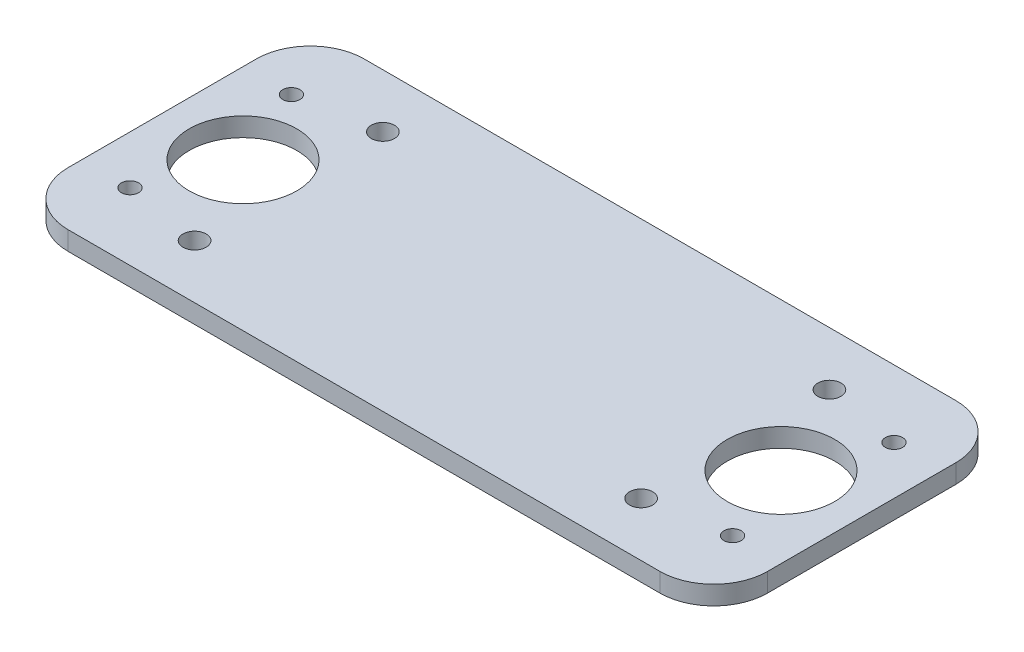
ISO-10303-21;
HEADER;
FILE_DESCRIPTION(('STEP AP214'),'2;1');
FILE_NAME('part.step','',(''),(''),'','','');
FILE_SCHEMA(('AUTOMOTIVE_DESIGN { 1 0 10303 214 1 1 1 1 }'));
ENDSEC;
DATA;
#1=APPLICATION_CONTEXT('core data for automotive mechanical design processes');
#2=APPLICATION_PROTOCOL_DEFINITION('international standard','automotive_design',2000,#1);
#3=PRODUCT_CONTEXT('',#1,'mechanical');
#4=PRODUCT('Part','Part','',(#3));
#5=PRODUCT_RELATED_PRODUCT_CATEGORY('part','',(#4));
#6=PRODUCT_DEFINITION_FORMATION('','',#4);
#7=PRODUCT_DEFINITION_CONTEXT('part definition',#1,'design');
#8=PRODUCT_DEFINITION('design','',#6,#7);
#9=PRODUCT_DEFINITION_SHAPE('','',#8);
#10=(LENGTH_UNIT() NAMED_UNIT(*) SI_UNIT(.MILLI.,.METRE.));
#11=(NAMED_UNIT(*) PLANE_ANGLE_UNIT() SI_UNIT($,.RADIAN.));
#12=(NAMED_UNIT(*) SI_UNIT($,.STERADIAN.) SOLID_ANGLE_UNIT());
#13=UNCERTAINTY_MEASURE_WITH_UNIT(LENGTH_MEASURE(1.E-05),#10,'distance_accuracy_value','');
#14=(GEOMETRIC_REPRESENTATION_CONTEXT(3) GLOBAL_UNCERTAINTY_ASSIGNED_CONTEXT((#13)) GLOBAL_UNIT_ASSIGNED_CONTEXT((#10,
#11,#12)) REPRESENTATION_CONTEXT('',''));
#15=CARTESIAN_POINT('',(0.,0.,0.));
#16=DIRECTION('',(0.,0.,1.));
#17=DIRECTION('',(1.,0.,0.));
#18=AXIS2_PLACEMENT_3D('',#15,#16,#17);
#19=CARTESIAN_POINT('',(0.,3.5,0.));
#20=DIRECTION('',(0.,1.,0.));
#21=DIRECTION('',(0.,0.,1.));
#22=AXIS2_PLACEMENT_3D('',#19,#20,#21);
#23=PLANE('',#22);
#24=CARTESIAN_POINT('',(15.,3.5,27.5));
#25=DIRECTION('',(0.,1.,0.));
#26=DIRECTION('',(0.,0.,1.));
#27=AXIS2_PLACEMENT_3D('',#24,#25,#26);
#28=CIRCLE('',#27,10.);
#29=CARTESIAN_POINT('',(15.,3.5,37.5));
#30=VERTEX_POINT('',#29);
#31=EDGE_CURVE('E255',#30,#30,#28,.T.);
#32=ORIENTED_EDGE('',*,*,#31,.F.);
#33=EDGE_LOOP('',(#32));
#34=FACE_BOUND('',#33,.T.);
#35=CARTESIAN_POINT('',(23.5,3.5,10.));
#36=DIRECTION('',(0.,1.,0.));
#37=DIRECTION('',(0.,0.,-1.));
#38=AXIS2_PLACEMENT_3D('',#35,#36,#37);
#39=CIRCLE('',#38,2.15);
#40=CARTESIAN_POINT('',(23.5,3.5,7.85));
#41=VERTEX_POINT('',#40);
#42=EDGE_CURVE('E239',#41,#41,#39,.T.);
#43=ORIENTED_EDGE('',*,*,#42,.F.);
#44=EDGE_LOOP('',(#43));
#45=FACE_BOUND('',#44,.T.);
#46=CARTESIAN_POINT('',(121.,3.5,42.5));
#47=DIRECTION('',(0.,1.,0.));
#48=DIRECTION('',(0.,0.,-1.));
#49=AXIS2_PLACEMENT_3D('',#46,#47,#48);
#50=CIRCLE('',#49,1.59999999999999);
#51=CARTESIAN_POINT('',(121.,3.5,40.9));
#52=VERTEX_POINT('',#51);
#53=EDGE_CURVE('E223',#52,#52,#50,.T.);
#54=ORIENTED_EDGE('',*,*,#53,.F.);
#55=EDGE_LOOP('',(#54));
#56=FACE_BOUND('',#55,.T.);
#57=CARTESIAN_POINT('',(106.5,3.5,10.));
#58=DIRECTION('',(0.,1.,0.));
#59=DIRECTION('',(0.,0.,1.));
#60=AXIS2_PLACEMENT_3D('',#57,#58,#59);
#61=CIRCLE('',#60,2.15);
#62=CARTESIAN_POINT('',(106.5,3.5,12.15));
#63=VERTEX_POINT('',#62);
#64=EDGE_CURVE('E207',#63,#63,#61,.T.);
#65=ORIENTED_EDGE('',*,*,#64,.F.);
#66=EDGE_LOOP('',(#65));
#67=FACE_BOUND('',#66,.T.);
#68=CARTESIAN_POINT('',(9.,3.5,12.5));
#69=DIRECTION('',(0.,1.,0.));
#70=DIRECTION('',(0.,0.,1.));
#71=AXIS2_PLACEMENT_3D('',#68,#69,#70);
#72=CIRCLE('',#71,1.6);
#73=CARTESIAN_POINT('',(9.,3.5,14.1));
#74=VERTEX_POINT('',#73);
#75=EDGE_CURVE('E137',#74,#74,#72,.T.);
#76=ORIENTED_EDGE('',*,*,#75,.F.);
#77=EDGE_LOOP('',(#76));
#78=FACE_BOUND('',#77,.T.);
#79=DIRECTION('',(-1.,0.,0.));
#80=VECTOR('',#79,1.);
#81=CARTESIAN_POINT('',(0.,3.5,0.));
#82=LINE('',#81,#80);
#83=CARTESIAN_POINT('',(120.,3.5,0.));
#84=VERTEX_POINT('',#83);
#85=CARTESIAN_POINT('',(10.,3.5,0.));
#86=VERTEX_POINT('',#85);
#87=EDGE_CURVE('E148',#84,#86,#82,.T.);
#88=ORIENTED_EDGE('',*,*,#87,.T.);
#89=CARTESIAN_POINT('',(10.,3.5,10.));
#90=DIRECTION('',(0.,1.,0.));
#91=DIRECTION('',(0.,0.,1.));
#92=AXIS2_PLACEMENT_3D('',#89,#90,#91);
#93=CIRCLE('',#92,10.);
#94=CARTESIAN_POINT('',(0.,3.5,10.));
#95=VERTEX_POINT('',#94);
#96=EDGE_CURVE('E178',#86,#95,#93,.T.);
#97=ORIENTED_EDGE('',*,*,#96,.T.);
#98=DIRECTION('',(0.,0.,1.));
#99=VECTOR('',#98,1.);
#100=CARTESIAN_POINT('',(0.,3.5,0.));
#101=LINE('',#100,#99);
#102=CARTESIAN_POINT('',(0.,3.5,45.));
#103=VERTEX_POINT('',#102);
#104=EDGE_CURVE('E127',#95,#103,#101,.T.);
#105=ORIENTED_EDGE('',*,*,#104,.T.);
#106=CARTESIAN_POINT('',(10.,3.5,45.));
#107=DIRECTION('',(0.,1.,0.));
#108=DIRECTION('',(0.,0.,1.));
#109=AXIS2_PLACEMENT_3D('',#106,#107,#108);
#110=CIRCLE('',#109,10.);
#111=CARTESIAN_POINT('',(10.,3.5,55.));
#112=VERTEX_POINT('',#111);
#113=EDGE_CURVE('E175',#103,#112,#110,.T.);
#114=ORIENTED_EDGE('',*,*,#113,.T.);
#115=DIRECTION('',(1.,0.,0.));
#116=VECTOR('',#115,1.);
#117=CARTESIAN_POINT('',(0.,3.5,55.));
#118=LINE('',#117,#116);
#119=CARTESIAN_POINT('',(120.,3.5,55.));
#120=VERTEX_POINT('',#119);
#121=EDGE_CURVE('E193',#112,#120,#118,.T.);
#122=ORIENTED_EDGE('',*,*,#121,.T.);
#123=CARTESIAN_POINT('',(120.,3.5,45.));
#124=DIRECTION('',(0.,1.,0.));
#125=DIRECTION('',(0.,0.,1.));
#126=AXIS2_PLACEMENT_3D('',#123,#124,#125);
#127=CIRCLE('',#126,10.);
#128=CARTESIAN_POINT('',(130.,3.5,45.));
#129=VERTEX_POINT('',#128);
#130=EDGE_CURVE('E61',#120,#129,#127,.T.);
#131=ORIENTED_EDGE('',*,*,#130,.T.);
#132=DIRECTION('',(0.,0.,-1.));
#133=VECTOR('',#132,1.);
#134=CARTESIAN_POINT('',(130.,3.5,0.));
#135=LINE('',#134,#133);
#136=CARTESIAN_POINT('',(130.,3.5,10.));
#137=VERTEX_POINT('',#136);
#138=EDGE_CURVE('E191',#129,#137,#135,.T.);
#139=ORIENTED_EDGE('',*,*,#138,.T.);
#140=CARTESIAN_POINT('',(120.,3.5,10.));
#141=DIRECTION('',(0.,1.,0.));
#142=DIRECTION('',(0.,0.,1.));
#143=AXIS2_PLACEMENT_3D('',#140,#141,#142);
#144=CIRCLE('',#143,10.);
#145=EDGE_CURVE('E170',#137,#84,#144,.T.);
#146=ORIENTED_EDGE('',*,*,#145,.T.);
#147=EDGE_LOOP('',(#88,#97,#105,#114,#122,#131,#139,#146));
#148=FACE_BOUND('',#147,.T.);
#149=CARTESIAN_POINT('',(9.00000000000007,3.5,42.5));
#150=DIRECTION('',(0.,1.,0.));
#151=DIRECTION('',(0.,0.,1.));
#152=AXIS2_PLACEMENT_3D('',#149,#150,#151);
#153=CIRCLE('',#152,1.59999999999993);
#154=CARTESIAN_POINT('',(9.00000000000007,3.5,44.0999999999999));
#155=VERTEX_POINT('',#154);
#156=EDGE_CURVE('E201',#155,#155,#153,.T.);
#157=ORIENTED_EDGE('',*,*,#156,.F.);
#158=EDGE_LOOP('',(#157));
#159=FACE_BOUND('',#158,.T.);
#160=CARTESIAN_POINT('',(106.5,3.5,45.));
#161=DIRECTION('',(0.,1.,0.));
#162=DIRECTION('',(0.,0.,1.));
#163=AXIS2_PLACEMENT_3D('',#160,#161,#162);
#164=CIRCLE('',#163,2.15);
#165=CARTESIAN_POINT('',(106.5,3.5,47.15));
#166=VERTEX_POINT('',#165);
#167=EDGE_CURVE('E215',#166,#166,#164,.T.);
#168=ORIENTED_EDGE('',*,*,#167,.F.);
#169=EDGE_LOOP('',(#168));
#170=FACE_BOUND('',#169,.T.);
#171=CARTESIAN_POINT('',(23.5,3.5,45.));
#172=DIRECTION('',(0.,1.,0.));
#173=DIRECTION('',(0.,0.,-1.));
#174=AXIS2_PLACEMENT_3D('',#171,#172,#173);
#175=CIRCLE('',#174,2.15);
#176=CARTESIAN_POINT('',(23.5,3.5,42.85));
#177=VERTEX_POINT('',#176);
#178=EDGE_CURVE('E231',#177,#177,#175,.T.);
#179=ORIENTED_EDGE('',*,*,#178,.F.);
#180=EDGE_LOOP('',(#179));
#181=FACE_BOUND('',#180,.T.);
#182=CARTESIAN_POINT('',(121.,3.5,12.5));
#183=DIRECTION('',(0.,1.,0.));
#184=DIRECTION('',(0.,0.,-1.));
#185=AXIS2_PLACEMENT_3D('',#182,#183,#184);
#186=CIRCLE('',#185,1.59999999999999);
#187=CARTESIAN_POINT('',(121.,3.5,10.9));
#188=VERTEX_POINT('',#187);
#189=EDGE_CURVE('E247',#188,#188,#186,.T.);
#190=ORIENTED_EDGE('',*,*,#189,.F.);
#191=EDGE_LOOP('',(#190));
#192=FACE_BOUND('',#191,.T.);
#193=CARTESIAN_POINT('',(115.,3.5,27.5));
#194=DIRECTION('',(0.,1.,0.));
#195=DIRECTION('',(0.,0.,1.));
#196=AXIS2_PLACEMENT_3D('',#193,#194,#195);
#197=CIRCLE('',#196,9.99999999999999);
#198=CARTESIAN_POINT('',(115.,3.5,37.5));
#199=VERTEX_POINT('',#198);
#200=EDGE_CURVE('E263',#199,#199,#197,.T.);
#201=ORIENTED_EDGE('',*,*,#200,.F.);
#202=EDGE_LOOP('',(#201));
#203=FACE_BOUND('',#202,.T.);
#204=ADVANCED_FACE('F39',(#34,#45,#56,#67,#78,#148,#159,#170,#181,#192,#203),#23,.T.);
#205=CARTESIAN_POINT('',(0.,0.,0.));
#206=DIRECTION('',(0.,1.,0.));
#207=DIRECTION('',(0.,0.,1.));
#208=AXIS2_PLACEMENT_3D('',#205,#206,#207);
#209=PLANE('',#208);
#210=DIRECTION('',(0.,0.,1.));
#211=VECTOR('',#210,1.);
#212=CARTESIAN_POINT('',(0.,0.,0.));
#213=LINE('',#212,#211);
#214=CARTESIAN_POINT('',(0.,0.,10.));
#215=VERTEX_POINT('',#214);
#216=CARTESIAN_POINT('',(0.,0.,45.));
#217=VERTEX_POINT('',#216);
#218=EDGE_CURVE('E124',#215,#217,#213,.T.);
#219=ORIENTED_EDGE('',*,*,#218,.F.);
#220=CARTESIAN_POINT('',(10.,0.,10.));
#221=DIRECTION('',(0.,1.,0.));
#222=DIRECTION('',(0.,0.,1.));
#223=AXIS2_PLACEMENT_3D('',#220,#221,#222);
#224=CIRCLE('',#223,10.);
#225=CARTESIAN_POINT('',(10.,0.,0.));
#226=VERTEX_POINT('',#225);
#227=EDGE_CURVE('E106',#215,#226,#224,.F.);
#228=ORIENTED_EDGE('',*,*,#227,.T.);
#229=DIRECTION('',(-1.,0.,0.));
#230=VECTOR('',#229,1.);
#231=CARTESIAN_POINT('',(0.,0.,0.));
#232=LINE('',#231,#230);
#233=CARTESIAN_POINT('',(120.,0.,0.));
#234=VERTEX_POINT('',#233);
#235=EDGE_CURVE('E153',#234,#226,#232,.T.);
#236=ORIENTED_EDGE('',*,*,#235,.F.);
#237=CARTESIAN_POINT('',(120.,0.,10.));
#238=DIRECTION('',(0.,1.,0.));
#239=DIRECTION('',(0.,0.,1.));
#240=AXIS2_PLACEMENT_3D('',#237,#238,#239);
#241=CIRCLE('',#240,10.);
#242=CARTESIAN_POINT('',(130.,0.,10.));
#243=VERTEX_POINT('',#242);
#244=EDGE_CURVE('E129',#234,#243,#241,.F.);
#245=ORIENTED_EDGE('',*,*,#244,.T.);
#246=DIRECTION('',(0.,0.,-1.));
#247=VECTOR('',#246,1.);
#248=CARTESIAN_POINT('',(130.,0.,0.));
#249=LINE('',#248,#247);
#250=CARTESIAN_POINT('',(130.,0.,45.));
#251=VERTEX_POINT('',#250);
#252=EDGE_CURVE('E142',#251,#243,#249,.T.);
#253=ORIENTED_EDGE('',*,*,#252,.F.);
#254=CARTESIAN_POINT('',(120.,0.,45.));
#255=DIRECTION('',(0.,1.,0.));
#256=DIRECTION('',(0.,0.,1.));
#257=AXIS2_PLACEMENT_3D('',#254,#255,#256);
#258=CIRCLE('',#257,10.);
#259=CARTESIAN_POINT('',(120.,0.,55.));
#260=VERTEX_POINT('',#259);
#261=EDGE_CURVE('E160',#251,#260,#258,.F.);
#262=ORIENTED_EDGE('',*,*,#261,.T.);
#263=DIRECTION('',(1.,0.,0.));
#264=VECTOR('',#263,1.);
#265=CARTESIAN_POINT('',(0.,0.,55.));
#266=LINE('',#265,#264);
#267=CARTESIAN_POINT('',(10.,0.,55.));
#268=VERTEX_POINT('',#267);
#269=EDGE_CURVE('E136',#268,#260,#266,.T.);
#270=ORIENTED_EDGE('',*,*,#269,.F.);
#271=CARTESIAN_POINT('',(10.,0.,45.));
#272=DIRECTION('',(0.,1.,0.));
#273=DIRECTION('',(0.,0.,1.));
#274=AXIS2_PLACEMENT_3D('',#271,#272,#273);
#275=CIRCLE('',#274,10.);
#276=EDGE_CURVE('E118',#268,#217,#275,.F.);
#277=ORIENTED_EDGE('',*,*,#276,.T.);
#278=EDGE_LOOP('',(#219,#228,#236,#245,#253,#262,#270,#277));
#279=FACE_BOUND('',#278,.T.);
#280=CARTESIAN_POINT('',(9.,0.,12.5));
#281=DIRECTION('',(0.,1.,0.));
#282=DIRECTION('',(0.,0.,1.));
#283=AXIS2_PLACEMENT_3D('',#280,#281,#282);
#284=CIRCLE('',#283,1.6);
#285=CARTESIAN_POINT('',(9.,0.,14.1));
#286=VERTEX_POINT('',#285);
#287=EDGE_CURVE('E145',#286,#286,#284,.T.);
#288=ORIENTED_EDGE('',*,*,#287,.T.);
#289=EDGE_LOOP('',(#288));
#290=FACE_BOUND('',#289,.T.);
#291=CARTESIAN_POINT('',(9.00000000000007,0.,42.5));
#292=DIRECTION('',(0.,1.,0.));
#293=DIRECTION('',(0.,0.,1.));
#294=AXIS2_PLACEMENT_3D('',#291,#292,#293);
#295=CIRCLE('',#294,1.59999999999993);
#296=CARTESIAN_POINT('',(9.00000000000007,0.,44.0999999999999));
#297=VERTEX_POINT('',#296);
#298=EDGE_CURVE('E203',#297,#297,#295,.T.);
#299=ORIENTED_EDGE('',*,*,#298,.T.);
#300=EDGE_LOOP('',(#299));
#301=FACE_BOUND('',#300,.T.);
#302=CARTESIAN_POINT('',(106.5,0.,10.));
#303=DIRECTION('',(0.,1.,0.));
#304=DIRECTION('',(0.,0.,1.));
#305=AXIS2_PLACEMENT_3D('',#302,#303,#304);
#306=CIRCLE('',#305,2.15);
#307=CARTESIAN_POINT('',(106.5,0.,12.15));
#308=VERTEX_POINT('',#307);
#309=EDGE_CURVE('E211',#308,#308,#306,.T.);
#310=ORIENTED_EDGE('',*,*,#309,.T.);
#311=EDGE_LOOP('',(#310));
#312=FACE_BOUND('',#311,.T.);
#313=CARTESIAN_POINT('',(106.5,0.,45.));
#314=DIRECTION('',(0.,1.,0.));
#315=DIRECTION('',(0.,0.,1.));
#316=AXIS2_PLACEMENT_3D('',#313,#314,#315);
#317=CIRCLE('',#316,2.15);
#318=CARTESIAN_POINT('',(106.5,0.,47.15));
#319=VERTEX_POINT('',#318);
#320=EDGE_CURVE('E219',#319,#319,#317,.T.);
#321=ORIENTED_EDGE('',*,*,#320,.T.);
#322=EDGE_LOOP('',(#321));
#323=FACE_BOUND('',#322,.T.);
#324=CARTESIAN_POINT('',(121.,0.,42.5));
#325=DIRECTION('',(0.,1.,0.));
#326=DIRECTION('',(0.,0.,-1.));
#327=AXIS2_PLACEMENT_3D('',#324,#325,#326);
#328=CIRCLE('',#327,1.59999999999999);
#329=CARTESIAN_POINT('',(121.,0.,40.9));
#330=VERTEX_POINT('',#329);
#331=EDGE_CURVE('E227',#330,#330,#328,.T.);
#332=ORIENTED_EDGE('',*,*,#331,.T.);
#333=EDGE_LOOP('',(#332));
#334=FACE_BOUND('',#333,.T.);
#335=CARTESIAN_POINT('',(23.5,0.,45.));
#336=DIRECTION('',(0.,1.,0.));
#337=DIRECTION('',(0.,0.,-1.));
#338=AXIS2_PLACEMENT_3D('',#335,#336,#337);
#339=CIRCLE('',#338,2.15);
#340=CARTESIAN_POINT('',(23.5,0.,42.85));
#341=VERTEX_POINT('',#340);
#342=EDGE_CURVE('E235',#341,#341,#339,.T.);
#343=ORIENTED_EDGE('',*,*,#342,.T.);
#344=EDGE_LOOP('',(#343));
#345=FACE_BOUND('',#344,.T.);
#346=CARTESIAN_POINT('',(23.5,0.,10.));
#347=DIRECTION('',(0.,1.,0.));
#348=DIRECTION('',(0.,0.,-1.));
#349=AXIS2_PLACEMENT_3D('',#346,#347,#348);
#350=CIRCLE('',#349,2.15);
#351=CARTESIAN_POINT('',(23.5,0.,7.85));
#352=VERTEX_POINT('',#351);
#353=EDGE_CURVE('E243',#352,#352,#350,.T.);
#354=ORIENTED_EDGE('',*,*,#353,.T.);
#355=EDGE_LOOP('',(#354));
#356=FACE_BOUND('',#355,.T.);
#357=CARTESIAN_POINT('',(121.,0.,12.5));
#358=DIRECTION('',(0.,1.,0.));
#359=DIRECTION('',(0.,0.,-1.));
#360=AXIS2_PLACEMENT_3D('',#357,#358,#359);
#361=CIRCLE('',#360,1.59999999999999);
#362=CARTESIAN_POINT('',(121.,0.,10.9));
#363=VERTEX_POINT('',#362);
#364=EDGE_CURVE('E251',#363,#363,#361,.T.);
#365=ORIENTED_EDGE('',*,*,#364,.T.);
#366=EDGE_LOOP('',(#365));
#367=FACE_BOUND('',#366,.T.);
#368=CARTESIAN_POINT('',(15.,0.,27.5));
#369=DIRECTION('',(0.,1.,0.));
#370=DIRECTION('',(0.,0.,1.));
#371=AXIS2_PLACEMENT_3D('',#368,#369,#370);
#372=CIRCLE('',#371,10.);
#373=CARTESIAN_POINT('',(15.,0.,37.5));
#374=VERTEX_POINT('',#373);
#375=EDGE_CURVE('E259',#374,#374,#372,.T.);
#376=ORIENTED_EDGE('',*,*,#375,.T.);
#377=EDGE_LOOP('',(#376));
#378=FACE_BOUND('',#377,.T.);
#379=CARTESIAN_POINT('',(115.,0.,27.5));
#380=DIRECTION('',(0.,1.,0.));
#381=DIRECTION('',(0.,0.,1.));
#382=AXIS2_PLACEMENT_3D('',#379,#380,#381);
#383=CIRCLE('',#382,9.99999999999999);
#384=CARTESIAN_POINT('',(115.,0.,37.5));
#385=VERTEX_POINT('',#384);
#386=EDGE_CURVE('E267',#385,#385,#383,.T.);
#387=ORIENTED_EDGE('',*,*,#386,.T.);
#388=EDGE_LOOP('',(#387));
#389=FACE_BOUND('',#388,.T.);
#390=ADVANCED_FACE('F132',(#279,#290,#301,#312,#323,#334,#345,#356,#367,#378,#389),#209,.F.);
#391=CARTESIAN_POINT('',(0.,3.5,0.));
#392=DIRECTION('',(1.,0.,0.));
#393=DIRECTION('',(0.,0.,-1.));
#394=AXIS2_PLACEMENT_3D('',#391,#392,#393);
#395=PLANE('',#394);
#396=ORIENTED_EDGE('',*,*,#104,.F.);
#397=DIRECTION('',(0.,-1.,0.));
#398=VECTOR('',#397,1.);
#399=CARTESIAN_POINT('',(0.,3.5,10.));
#400=LINE('',#399,#398);
#401=EDGE_CURVE('E110',#95,#215,#400,.T.);
#402=ORIENTED_EDGE('',*,*,#401,.T.);
#403=ORIENTED_EDGE('',*,*,#218,.T.);
#404=DIRECTION('',(0.,-1.,0.));
#405=VECTOR('',#404,1.);
#406=CARTESIAN_POINT('',(0.,3.5,45.));
#407=LINE('',#406,#405);
#408=EDGE_CURVE('E130',#217,#103,#407,.F.);
#409=ORIENTED_EDGE('',*,*,#408,.T.);
#410=EDGE_LOOP('',(#396,#402,#403,#409));
#411=FACE_BOUND('',#410,.T.);
#412=ADVANCED_FACE('F123',(#411),#395,.F.);
#413=CARTESIAN_POINT('',(0.,3.5,55.));
#414=DIRECTION('',(0.,0.,-1.));
#415=DIRECTION('',(-1.,0.,0.));
#416=AXIS2_PLACEMENT_3D('',#413,#414,#415);
#417=PLANE('',#416);
#418=ORIENTED_EDGE('',*,*,#121,.F.);
#419=DIRECTION('',(0.,-1.,0.));
#420=VECTOR('',#419,1.);
#421=CARTESIAN_POINT('',(10.,3.5,55.));
#422=LINE('',#421,#420);
#423=EDGE_CURVE('E184',#112,#268,#422,.T.);
#424=ORIENTED_EDGE('',*,*,#423,.T.);
#425=ORIENTED_EDGE('',*,*,#269,.T.);
#426=DIRECTION('',(0.,-1.,0.));
#427=VECTOR('',#426,1.);
#428=CARTESIAN_POINT('',(120.,3.5,55.));
#429=LINE('',#428,#427);
#430=EDGE_CURVE('E181',#260,#120,#429,.F.);
#431=ORIENTED_EDGE('',*,*,#430,.T.);
#432=EDGE_LOOP('',(#418,#424,#425,#431));
#433=FACE_BOUND('',#432,.T.);
#434=ADVANCED_FACE('F298',(#433),#417,.F.);
#435=CARTESIAN_POINT('',(130.,3.5,0.));
#436=DIRECTION('',(-1.,0.,0.));
#437=DIRECTION('',(0.,0.,1.));
#438=AXIS2_PLACEMENT_3D('',#435,#436,#437);
#439=PLANE('',#438);
#440=ORIENTED_EDGE('',*,*,#138,.F.);
#441=DIRECTION('',(0.,-1.,0.));
#442=VECTOR('',#441,1.);
#443=CARTESIAN_POINT('',(130.,3.5,45.));
#444=LINE('',#443,#442);
#445=EDGE_CURVE('E11',#129,#251,#444,.T.);
#446=ORIENTED_EDGE('',*,*,#445,.T.);
#447=ORIENTED_EDGE('',*,*,#252,.T.);
#448=DIRECTION('',(0.,-1.,0.));
#449=VECTOR('',#448,1.);
#450=CARTESIAN_POINT('',(130.,3.5,10.));
#451=LINE('',#450,#449);
#452=EDGE_CURVE('E48',#243,#137,#451,.F.);
#453=ORIENTED_EDGE('',*,*,#452,.T.);
#454=EDGE_LOOP('',(#440,#446,#447,#453));
#455=FACE_BOUND('',#454,.T.);
#456=ADVANCED_FACE('F294',(#455),#439,.F.);
#457=CARTESIAN_POINT('',(0.,3.5,0.));
#458=DIRECTION('',(0.,0.,1.));
#459=DIRECTION('',(1.,0.,0.));
#460=AXIS2_PLACEMENT_3D('',#457,#458,#459);
#461=PLANE('',#460);
#462=ORIENTED_EDGE('',*,*,#235,.T.);
#463=DIRECTION('',(0.,-1.,0.));
#464=VECTOR('',#463,1.);
#465=CARTESIAN_POINT('',(10.,3.5,0.));
#466=LINE('',#465,#464);
#467=EDGE_CURVE('E111',#226,#86,#466,.F.);
#468=ORIENTED_EDGE('',*,*,#467,.T.);
#469=ORIENTED_EDGE('',*,*,#87,.F.);
#470=DIRECTION('',(0.,-1.,0.));
#471=VECTOR('',#470,1.);
#472=CARTESIAN_POINT('',(120.,3.5,0.));
#473=LINE('',#472,#471);
#474=EDGE_CURVE('E117',#84,#234,#473,.T.);
#475=ORIENTED_EDGE('',*,*,#474,.T.);
#476=EDGE_LOOP('',(#462,#468,#469,#475));
#477=FACE_BOUND('',#476,.T.);
#478=ADVANCED_FACE('F291',(#477),#461,.F.);
#479=CARTESIAN_POINT('',(9.,3.5,12.5));
#480=DIRECTION('',(0.,-1.,0.));
#481=DIRECTION('',(0.,0.,-1.));
#482=AXIS2_PLACEMENT_3D('',#479,#480,#481);
#483=CYLINDRICAL_SURFACE('',#482,1.6);
#484=ORIENTED_EDGE('',*,*,#75,.T.);
#485=EDGE_LOOP('',(#484));
#486=FACE_BOUND('',#485,.T.);
#487=ORIENTED_EDGE('',*,*,#287,.F.);
#488=EDGE_LOOP('',(#487));
#489=FACE_BOUND('',#488,.T.);
#490=ADVANCED_FACE('F288',(#486,#489),#483,.F.);
#491=CARTESIAN_POINT('',(9.00000000000007,3.5,42.5));
#492=DIRECTION('',(0.,-1.,0.));
#493=DIRECTION('',(0.,0.,-1.));
#494=AXIS2_PLACEMENT_3D('',#491,#492,#493);
#495=CYLINDRICAL_SURFACE('',#494,1.59999999999993);
#496=ORIENTED_EDGE('',*,*,#156,.T.);
#497=EDGE_LOOP('',(#496));
#498=FACE_BOUND('',#497,.T.);
#499=ORIENTED_EDGE('',*,*,#298,.F.);
#500=EDGE_LOOP('',(#499));
#501=FACE_BOUND('',#500,.T.);
#502=ADVANCED_FACE('F368',(#498,#501),#495,.F.);
#503=CARTESIAN_POINT('',(106.5,3.5,10.));
#504=DIRECTION('',(0.,-1.,0.));
#505=DIRECTION('',(0.,0.,-1.));
#506=AXIS2_PLACEMENT_3D('',#503,#504,#505);
#507=CYLINDRICAL_SURFACE('',#506,2.15);
#508=ORIENTED_EDGE('',*,*,#64,.T.);
#509=EDGE_LOOP('',(#508));
#510=FACE_BOUND('',#509,.T.);
#511=ORIENTED_EDGE('',*,*,#309,.F.);
#512=EDGE_LOOP('',(#511));
#513=FACE_BOUND('',#512,.T.);
#514=ADVANCED_FACE('F365',(#510,#513),#507,.F.);
#515=CARTESIAN_POINT('',(106.5,3.5,45.));
#516=DIRECTION('',(0.,-1.,0.));
#517=DIRECTION('',(0.,0.,-1.));
#518=AXIS2_PLACEMENT_3D('',#515,#516,#517);
#519=CYLINDRICAL_SURFACE('',#518,2.15);
#520=ORIENTED_EDGE('',*,*,#167,.T.);
#521=EDGE_LOOP('',(#520));
#522=FACE_BOUND('',#521,.T.);
#523=ORIENTED_EDGE('',*,*,#320,.F.);
#524=EDGE_LOOP('',(#523));
#525=FACE_BOUND('',#524,.T.);
#526=ADVANCED_FACE('F361',(#522,#525),#519,.F.);
#527=CARTESIAN_POINT('',(121.,3.5,42.5));
#528=DIRECTION('',(0.,-1.,0.));
#529=DIRECTION('',(0.,0.,-1.));
#530=AXIS2_PLACEMENT_3D('',#527,#528,#529);
#531=CYLINDRICAL_SURFACE('',#530,1.59999999999999);
#532=ORIENTED_EDGE('',*,*,#53,.T.);
#533=EDGE_LOOP('',(#532));
#534=FACE_BOUND('',#533,.T.);
#535=ORIENTED_EDGE('',*,*,#331,.F.);
#536=EDGE_LOOP('',(#535));
#537=FACE_BOUND('',#536,.T.);
#538=ADVANCED_FACE('F357',(#534,#537),#531,.F.);
#539=CARTESIAN_POINT('',(23.5,3.5,45.));
#540=DIRECTION('',(0.,-1.,0.));
#541=DIRECTION('',(0.,0.,-1.));
#542=AXIS2_PLACEMENT_3D('',#539,#540,#541);
#543=CYLINDRICAL_SURFACE('',#542,2.15);
#544=ORIENTED_EDGE('',*,*,#178,.T.);
#545=EDGE_LOOP('',(#544));
#546=FACE_BOUND('',#545,.T.);
#547=ORIENTED_EDGE('',*,*,#342,.F.);
#548=EDGE_LOOP('',(#547));
#549=FACE_BOUND('',#548,.T.);
#550=ADVANCED_FACE('F353',(#546,#549),#543,.F.);
#551=CARTESIAN_POINT('',(23.5,3.5,10.));
#552=DIRECTION('',(0.,-1.,0.));
#553=DIRECTION('',(0.,0.,-1.));
#554=AXIS2_PLACEMENT_3D('',#551,#552,#553);
#555=CYLINDRICAL_SURFACE('',#554,2.15);
#556=ORIENTED_EDGE('',*,*,#42,.T.);
#557=EDGE_LOOP('',(#556));
#558=FACE_BOUND('',#557,.T.);
#559=ORIENTED_EDGE('',*,*,#353,.F.);
#560=EDGE_LOOP('',(#559));
#561=FACE_BOUND('',#560,.T.);
#562=ADVANCED_FACE('F335',(#558,#561),#555,.F.);
#563=CARTESIAN_POINT('',(121.,3.5,12.5));
#564=DIRECTION('',(0.,-1.,0.));
#565=DIRECTION('',(0.,0.,-1.));
#566=AXIS2_PLACEMENT_3D('',#563,#564,#565);
#567=CYLINDRICAL_SURFACE('',#566,1.59999999999999);
#568=ORIENTED_EDGE('',*,*,#189,.T.);
#569=EDGE_LOOP('',(#568));
#570=FACE_BOUND('',#569,.T.);
#571=ORIENTED_EDGE('',*,*,#364,.F.);
#572=EDGE_LOOP('',(#571));
#573=FACE_BOUND('',#572,.T.);
#574=ADVANCED_FACE('F331',(#570,#573),#567,.F.);
#575=CARTESIAN_POINT('',(15.,3.5,27.5));
#576=DIRECTION('',(0.,-1.,0.));
#577=DIRECTION('',(0.,0.,-1.));
#578=AXIS2_PLACEMENT_3D('',#575,#576,#577);
#579=CYLINDRICAL_SURFACE('',#578,10.);
#580=ORIENTED_EDGE('',*,*,#31,.T.);
#581=EDGE_LOOP('',(#580));
#582=FACE_BOUND('',#581,.T.);
#583=ORIENTED_EDGE('',*,*,#375,.F.);
#584=EDGE_LOOP('',(#583));
#585=FACE_BOUND('',#584,.T.);
#586=ADVANCED_FACE('F334',(#582,#585),#579,.F.);
#587=CARTESIAN_POINT('',(115.,3.5,27.5));
#588=DIRECTION('',(0.,-1.,0.));
#589=DIRECTION('',(0.,0.,-1.));
#590=AXIS2_PLACEMENT_3D('',#587,#588,#589);
#591=CYLINDRICAL_SURFACE('',#590,9.99999999999999);
#592=ORIENTED_EDGE('',*,*,#200,.T.);
#593=EDGE_LOOP('',(#592));
#594=FACE_BOUND('',#593,.T.);
#595=ORIENTED_EDGE('',*,*,#386,.F.);
#596=EDGE_LOOP('',(#595));
#597=FACE_BOUND('',#596,.T.);
#598=ADVANCED_FACE('F275',(#594,#597),#591,.F.);
#599=CARTESIAN_POINT('',(10.,3.5,10.));
#600=DIRECTION('',(0.,-1.,0.));
#601=DIRECTION('',(0.,0.,-1.));
#602=AXIS2_PLACEMENT_3D('',#599,#600,#601);
#603=CYLINDRICAL_SURFACE('',#602,10.);
#604=ORIENTED_EDGE('',*,*,#96,.F.);
#605=ORIENTED_EDGE('',*,*,#467,.F.);
#606=ORIENTED_EDGE('',*,*,#227,.F.);
#607=ORIENTED_EDGE('',*,*,#401,.F.);
#608=EDGE_LOOP('',(#604,#605,#606,#607));
#609=FACE_BOUND('',#608,.T.);
#610=ADVANCED_FACE('F109',(#609),#603,.T.);
#611=CARTESIAN_POINT('',(10.,3.5,45.));
#612=DIRECTION('',(0.,-1.,0.));
#613=DIRECTION('',(0.,0.,-1.));
#614=AXIS2_PLACEMENT_3D('',#611,#612,#613);
#615=CYLINDRICAL_SURFACE('',#614,10.);
#616=ORIENTED_EDGE('',*,*,#113,.F.);
#617=ORIENTED_EDGE('',*,*,#408,.F.);
#618=ORIENTED_EDGE('',*,*,#276,.F.);
#619=ORIENTED_EDGE('',*,*,#423,.F.);
#620=EDGE_LOOP('',(#616,#617,#618,#619));
#621=FACE_BOUND('',#620,.T.);
#622=ADVANCED_FACE('F306',(#621),#615,.T.);
#623=CARTESIAN_POINT('',(120.,3.5,45.));
#624=DIRECTION('',(0.,-1.,0.));
#625=DIRECTION('',(0.,0.,-1.));
#626=AXIS2_PLACEMENT_3D('',#623,#624,#625);
#627=CYLINDRICAL_SURFACE('',#626,10.);
#628=ORIENTED_EDGE('',*,*,#130,.F.);
#629=ORIENTED_EDGE('',*,*,#430,.F.);
#630=ORIENTED_EDGE('',*,*,#261,.F.);
#631=ORIENTED_EDGE('',*,*,#445,.F.);
#632=EDGE_LOOP('',(#628,#629,#630,#631));
#633=FACE_BOUND('',#632,.T.);
#634=ADVANCED_FACE('F308',(#633),#627,.T.);
#635=CARTESIAN_POINT('',(120.,3.5,10.));
#636=DIRECTION('',(0.,-1.,0.));
#637=DIRECTION('',(0.,0.,-1.));
#638=AXIS2_PLACEMENT_3D('',#635,#636,#637);
#639=CYLINDRICAL_SURFACE('',#638,10.);
#640=ORIENTED_EDGE('',*,*,#145,.F.);
#641=ORIENTED_EDGE('',*,*,#452,.F.);
#642=ORIENTED_EDGE('',*,*,#244,.F.);
#643=ORIENTED_EDGE('',*,*,#474,.F.);
#644=EDGE_LOOP('',(#640,#641,#642,#643));
#645=FACE_BOUND('',#644,.T.);
#646=ADVANCED_FACE('F41',(#645),#639,.T.);
#647=CLOSED_SHELL('',(#204,#390,#412,#434,#456,#478,#490,#502,#514,#526,#538,#550,#562,#574,
#586,#598,#610,#622,#634,#646));
#648=MANIFOLD_SOLID_BREP('B2',#647);
#649=ADVANCED_BREP_SHAPE_REPRESENTATION('',(#18,#648),#14);
#650=SHAPE_DEFINITION_REPRESENTATION(#9,#649);
ENDSEC;
END-ISO-10303-21;
